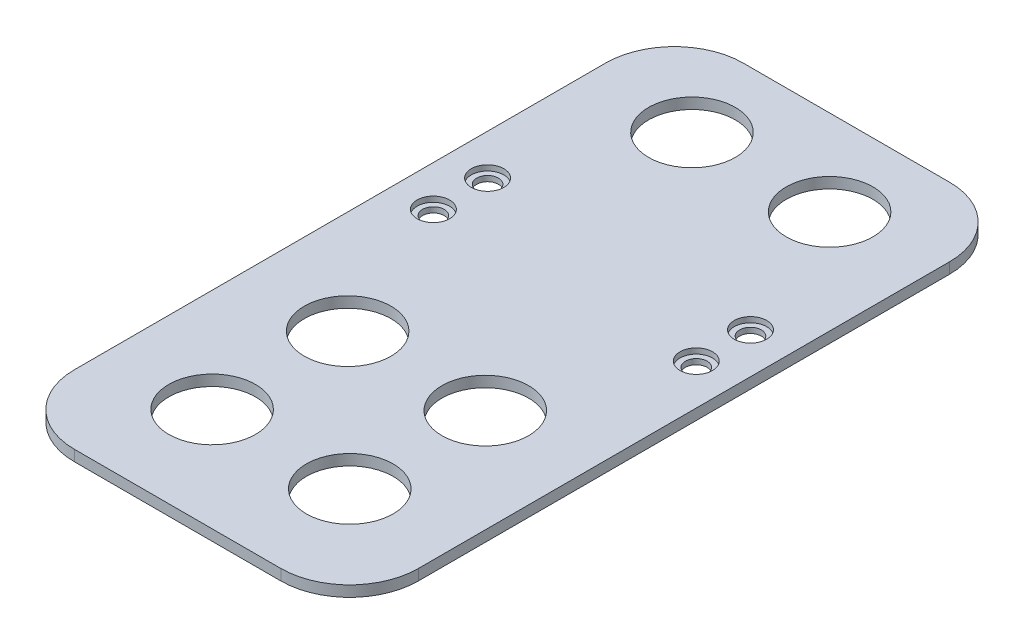
ISO-10303-21;
HEADER;
FILE_DESCRIPTION(('STEP AP214'),'2;1');
FILE_NAME('part.step','',(''),(''),'','','');
FILE_SCHEMA(('AUTOMOTIVE_DESIGN { 1 0 10303 214 1 1 1 1 }'));
ENDSEC;
DATA;
#1=APPLICATION_CONTEXT('core data for automotive mechanical design processes');
#2=APPLICATION_PROTOCOL_DEFINITION('international standard','automotive_design',2000,#1);
#3=PRODUCT_CONTEXT('',#1,'mechanical');
#4=PRODUCT('Part','Part','',(#3));
#5=PRODUCT_RELATED_PRODUCT_CATEGORY('part','',(#4));
#6=PRODUCT_DEFINITION_FORMATION('','',#4);
#7=PRODUCT_DEFINITION_CONTEXT('part definition',#1,'design');
#8=PRODUCT_DEFINITION('design','',#6,#7);
#9=PRODUCT_DEFINITION_SHAPE('','',#8);
#10=(LENGTH_UNIT() NAMED_UNIT(*) SI_UNIT(.MILLI.,.METRE.));
#11=(NAMED_UNIT(*) PLANE_ANGLE_UNIT() SI_UNIT($,.RADIAN.));
#12=(NAMED_UNIT(*) SI_UNIT($,.STERADIAN.) SOLID_ANGLE_UNIT());
#13=UNCERTAINTY_MEASURE_WITH_UNIT(LENGTH_MEASURE(1.E-05),#10,'distance_accuracy_value','');
#14=(GEOMETRIC_REPRESENTATION_CONTEXT(3) GLOBAL_UNCERTAINTY_ASSIGNED_CONTEXT((#13)) GLOBAL_UNIT_ASSIGNED_CONTEXT((#10,
#11,#12)) REPRESENTATION_CONTEXT('',''));
#15=CARTESIAN_POINT('',(0.,0.,0.));
#16=DIRECTION('',(0.,0.,1.));
#17=DIRECTION('',(1.,0.,0.));
#18=AXIS2_PLACEMENT_3D('',#15,#16,#17);
#19=CARTESIAN_POINT('',(24.26,2.,-9.75000000000002));
#20=DIRECTION('',(0.,-1.,0.));
#21=DIRECTION('',(0.,0.,-1.));
#22=AXIS2_PLACEMENT_3D('',#19,#20,#21);
#23=CYLINDRICAL_SURFACE('',#22,2.);
#24=CARTESIAN_POINT('',(24.26,0.,-9.75000000000002));
#25=DIRECTION('',(0.,1.,0.));
#26=DIRECTION('',(0.,0.,1.));
#27=AXIS2_PLACEMENT_3D('',#24,#25,#26);
#28=CIRCLE('',#27,2.);
#29=CARTESIAN_POINT('',(24.26,0.,-7.75000000000002));
#30=VERTEX_POINT('',#29);
#31=EDGE_CURVE('E166',#30,#30,#28,.T.);
#32=ORIENTED_EDGE('',*,*,#31,.F.);
#33=EDGE_LOOP('',(#32));
#34=FACE_BOUND('',#33,.T.);
#35=CARTESIAN_POINT('',(24.26,1.,-9.75000000000002));
#36=DIRECTION('',(0.,1.,0.));
#37=DIRECTION('',(0.,0.,1.));
#38=AXIS2_PLACEMENT_3D('',#35,#36,#37);
#39=CIRCLE('',#38,2.);
#40=CARTESIAN_POINT('',(24.26,1.,-7.75000000000002));
#41=VERTEX_POINT('',#40);
#42=EDGE_CURVE('E40',#41,#41,#39,.T.);
#43=ORIENTED_EDGE('',*,*,#42,.T.);
#44=EDGE_LOOP('',(#43));
#45=FACE_BOUND('',#44,.T.);
#46=ADVANCED_FACE('F36',(#34,#45),#23,.F.);
#47=CARTESIAN_POINT('',(24.26,2.,-19.75));
#48=DIRECTION('',(0.,-1.,0.));
#49=DIRECTION('',(0.,0.,-1.));
#50=AXIS2_PLACEMENT_3D('',#47,#48,#49);
#51=CYLINDRICAL_SURFACE('',#50,2.00000000000001);
#52=CARTESIAN_POINT('',(24.26,0.,-19.75));
#53=DIRECTION('',(0.,1.,0.));
#54=DIRECTION('',(0.,0.,1.));
#55=AXIS2_PLACEMENT_3D('',#52,#53,#54);
#56=CIRCLE('',#55,2.00000000000001);
#57=CARTESIAN_POINT('',(24.26,0.,-17.75));
#58=VERTEX_POINT('',#57);
#59=EDGE_CURVE('E199',#58,#58,#56,.T.);
#60=ORIENTED_EDGE('',*,*,#59,.F.);
#61=EDGE_LOOP('',(#60));
#62=FACE_BOUND('',#61,.T.);
#63=CARTESIAN_POINT('',(24.26,1.,-19.75));
#64=DIRECTION('',(0.,1.,0.));
#65=DIRECTION('',(0.,0.,1.));
#66=AXIS2_PLACEMENT_3D('',#63,#64,#65);
#67=CIRCLE('',#66,2.00000000000001);
#68=CARTESIAN_POINT('',(24.26,1.,-17.75));
#69=VERTEX_POINT('',#68);
#70=EDGE_CURVE('E172',#69,#69,#67,.T.);
#71=ORIENTED_EDGE('',*,*,#70,.T.);
#72=EDGE_LOOP('',(#71));
#73=FACE_BOUND('',#72,.T.);
#74=ADVANCED_FACE('F280',(#62,#73),#51,.F.);
#75=CARTESIAN_POINT('',(-24.26,2.,-9.75000000000001));
#76=DIRECTION('',(0.,-1.,0.));
#77=DIRECTION('',(0.,0.,-1.));
#78=AXIS2_PLACEMENT_3D('',#75,#76,#77);
#79=CYLINDRICAL_SURFACE('',#78,2.);
#80=CARTESIAN_POINT('',(-24.26,0.,-9.75000000000001));
#81=DIRECTION('',(0.,1.,0.));
#82=DIRECTION('',(0.,0.,1.));
#83=AXIS2_PLACEMENT_3D('',#80,#81,#82);
#84=CIRCLE('',#83,2.);
#85=CARTESIAN_POINT('',(-24.26,0.,-7.75));
#86=VERTEX_POINT('',#85);
#87=EDGE_CURVE('E202',#86,#86,#84,.T.);
#88=ORIENTED_EDGE('',*,*,#87,.F.);
#89=EDGE_LOOP('',(#88));
#90=FACE_BOUND('',#89,.T.);
#91=CARTESIAN_POINT('',(-24.26,1.,-9.75000000000001));
#92=DIRECTION('',(0.,1.,0.));
#93=DIRECTION('',(0.,0.,1.));
#94=AXIS2_PLACEMENT_3D('',#91,#92,#93);
#95=CIRCLE('',#94,2.);
#96=CARTESIAN_POINT('',(-24.26,1.,-7.75));
#97=VERTEX_POINT('',#96);
#98=EDGE_CURVE('E168',#97,#97,#95,.T.);
#99=ORIENTED_EDGE('',*,*,#98,.T.);
#100=EDGE_LOOP('',(#99));
#101=FACE_BOUND('',#100,.T.);
#102=ADVANCED_FACE('F286',(#90,#101),#79,.F.);
#103=CARTESIAN_POINT('',(-24.26,2.,-19.75));
#104=DIRECTION('',(0.,-1.,0.));
#105=DIRECTION('',(0.,0.,-1.));
#106=AXIS2_PLACEMENT_3D('',#103,#104,#105);
#107=CYLINDRICAL_SURFACE('',#106,2.);
#108=CARTESIAN_POINT('',(-24.26,0.,-19.75));
#109=DIRECTION('',(0.,1.,0.));
#110=DIRECTION('',(0.,0.,1.));
#111=AXIS2_PLACEMENT_3D('',#108,#109,#110);
#112=CIRCLE('',#111,2.);
#113=CARTESIAN_POINT('',(-24.26,0.,-17.75));
#114=VERTEX_POINT('',#113);
#115=EDGE_CURVE('E205',#114,#114,#112,.T.);
#116=ORIENTED_EDGE('',*,*,#115,.F.);
#117=EDGE_LOOP('',(#116));
#118=FACE_BOUND('',#117,.T.);
#119=CARTESIAN_POINT('',(-24.26,1.,-19.75));
#120=DIRECTION('',(0.,1.,0.));
#121=DIRECTION('',(0.,0.,1.));
#122=AXIS2_PLACEMENT_3D('',#119,#120,#121);
#123=CIRCLE('',#122,2.);
#124=CARTESIAN_POINT('',(-24.26,1.,-17.75));
#125=VERTEX_POINT('',#124);
#126=EDGE_CURVE('E163',#125,#125,#123,.T.);
#127=ORIENTED_EDGE('',*,*,#126,.T.);
#128=EDGE_LOOP('',(#127));
#129=FACE_BOUND('',#128,.T.);
#130=ADVANCED_FACE('F297',(#118,#129),#107,.F.);
#131=CARTESIAN_POINT('',(-19.05,2.,-49.02));
#132=DIRECTION('',(0.,1.,0.));
#133=DIRECTION('',(0.,0.,1.));
#134=AXIS2_PLACEMENT_3D('',#131,#132,#133);
#135=PLANE('',#134);
#136=CARTESIAN_POINT('',(24.26,2.,-9.75000000000002));
#137=DIRECTION('',(0.,1.,0.));
#138=DIRECTION('',(0.,0.,1.));
#139=AXIS2_PLACEMENT_3D('',#136,#137,#138);
#140=CIRCLE('',#139,3.);
#141=CARTESIAN_POINT('',(24.26,2.,-6.75000000000002));
#142=VERTEX_POINT('',#141);
#143=EDGE_CURVE('E188',#142,#142,#140,.T.);
#144=ORIENTED_EDGE('',*,*,#143,.F.);
#145=EDGE_LOOP('',(#144));
#146=FACE_BOUND('',#145,.T.);
#147=CARTESIAN_POINT('',(24.26,2.,-19.75));
#148=DIRECTION('',(0.,1.,0.));
#149=DIRECTION('',(0.,0.,1.));
#150=AXIS2_PLACEMENT_3D('',#147,#148,#149);
#151=CIRCLE('',#150,3.);
#152=CARTESIAN_POINT('',(24.26,2.,-16.75));
#153=VERTEX_POINT('',#152);
#154=EDGE_CURVE('E181',#153,#153,#151,.T.);
#155=ORIENTED_EDGE('',*,*,#154,.F.);
#156=EDGE_LOOP('',(#155));
#157=FACE_BOUND('',#156,.T.);
#158=CARTESIAN_POINT('',(-24.26,2.,-9.75000000000001));
#159=DIRECTION('',(0.,1.,0.));
#160=DIRECTION('',(0.,0.,1.));
#161=AXIS2_PLACEMENT_3D('',#158,#159,#160);
#162=CIRCLE('',#161,3.);
#163=CARTESIAN_POINT('',(-24.26,2.,-6.75));
#164=VERTEX_POINT('',#163);
#165=EDGE_CURVE('E174',#164,#164,#162,.T.);
#166=ORIENTED_EDGE('',*,*,#165,.F.);
#167=EDGE_LOOP('',(#166));
#168=FACE_BOUND('',#167,.T.);
#169=CARTESIAN_POINT('',(-24.26,2.,-19.75));
#170=DIRECTION('',(0.,1.,0.));
#171=DIRECTION('',(0.,0.,1.));
#172=AXIS2_PLACEMENT_3D('',#169,#170,#171);
#173=CIRCLE('',#172,3.);
#174=CARTESIAN_POINT('',(-24.26,2.,-16.75));
#175=VERTEX_POINT('',#174);
#176=EDGE_CURVE('E170',#175,#175,#173,.T.);
#177=ORIENTED_EDGE('',*,*,#176,.F.);
#178=EDGE_LOOP('',(#177));
#179=FACE_BOUND('',#178,.T.);
#180=CARTESIAN_POINT('',(12.7,2.,17.63));
#181=DIRECTION('',(0.,1.,0.));
#182=DIRECTION('',(0.,0.,1.));
#183=AXIS2_PLACEMENT_3D('',#180,#181,#182);
#184=CIRCLE('',#183,8.);
#185=CARTESIAN_POINT('',(12.7,2.,25.63));
#186=VERTEX_POINT('',#185);
#187=EDGE_CURVE('E215',#186,#186,#184,.T.);
#188=ORIENTED_EDGE('',*,*,#187,.F.);
#189=EDGE_LOOP('',(#188));
#190=FACE_BOUND('',#189,.T.);
#191=CARTESIAN_POINT('',(-12.7,2.,42.64));
#192=DIRECTION('',(0.,1.,0.));
#193=DIRECTION('',(0.,0.,1.));
#194=AXIS2_PLACEMENT_3D('',#191,#192,#193);
#195=CIRCLE('',#194,8.);
#196=CARTESIAN_POINT('',(-12.7,2.,50.64));
#197=VERTEX_POINT('',#196);
#198=EDGE_CURVE('E227',#197,#197,#195,.T.);
#199=ORIENTED_EDGE('',*,*,#198,.F.);
#200=EDGE_LOOP('',(#199));
#201=FACE_BOUND('',#200,.T.);
#202=CARTESIAN_POINT('',(-12.7,2.,-45.91));
#203=DIRECTION('',(0.,1.,0.));
#204=DIRECTION('',(0.,0.,1.));
#205=AXIS2_PLACEMENT_3D('',#202,#203,#204);
#206=CIRCLE('',#205,8.);
#207=CARTESIAN_POINT('',(-12.7,2.,-37.91));
#208=VERTEX_POINT('',#207);
#209=EDGE_CURVE('E140',#208,#208,#206,.T.);
#210=ORIENTED_EDGE('',*,*,#209,.F.);
#211=EDGE_LOOP('',(#210));
#212=FACE_BOUND('',#211,.T.);
#213=CARTESIAN_POINT('',(-19.05,2.,-49.02));
#214=DIRECTION('',(0.,1.,0.));
#215=DIRECTION('',(0.,0.,1.));
#216=AXIS2_PLACEMENT_3D('',#213,#214,#215);
#217=CIRCLE('',#216,12.7);
#218=CARTESIAN_POINT('',(-19.0499999999999,2.,-61.72));
#219=VERTEX_POINT('',#218);
#220=CARTESIAN_POINT('',(-31.75,2.,-49.0199999999999));
#221=VERTEX_POINT('',#220);
#222=EDGE_CURVE('E151',#219,#221,#217,.T.);
#223=ORIENTED_EDGE('',*,*,#222,.T.);
#224=DIRECTION('',(0.,0.,1.));
#225=VECTOR('',#224,1.);
#226=CARTESIAN_POINT('',(-31.75,2.,49.0199999999999));
#227=LINE('',#226,#225);
#228=CARTESIAN_POINT('',(-31.75,2.,49.0199999999999));
#229=VERTEX_POINT('',#228);
#230=EDGE_CURVE('E98',#221,#229,#227,.T.);
#231=ORIENTED_EDGE('',*,*,#230,.T.);
#232=CARTESIAN_POINT('',(-19.05,2.,49.02));
#233=DIRECTION('',(0.,1.,0.));
#234=DIRECTION('',(0.,0.,-1.));
#235=AXIS2_PLACEMENT_3D('',#232,#233,#234);
#236=CIRCLE('',#235,12.7);
#237=CARTESIAN_POINT('',(-19.0499999999999,2.,61.72));
#238=VERTEX_POINT('',#237);
#239=EDGE_CURVE('E245',#229,#238,#236,.T.);
#240=ORIENTED_EDGE('',*,*,#239,.T.);
#241=DIRECTION('',(1.,0.,0.));
#242=VECTOR('',#241,1.);
#243=CARTESIAN_POINT('',(19.0499999999999,2.,61.72));
#244=LINE('',#243,#242);
#245=CARTESIAN_POINT('',(19.0499999999999,2.,61.72));
#246=VERTEX_POINT('',#245);
#247=EDGE_CURVE('E247',#238,#246,#244,.T.);
#248=ORIENTED_EDGE('',*,*,#247,.T.);
#249=CARTESIAN_POINT('',(19.05,2.,49.02));
#250=DIRECTION('',(0.,1.,0.));
#251=DIRECTION('',(0.,0.,-1.));
#252=AXIS2_PLACEMENT_3D('',#249,#250,#251);
#253=CIRCLE('',#252,12.7);
#254=CARTESIAN_POINT('',(31.75,2.,49.0199999999999));
#255=VERTEX_POINT('',#254);
#256=EDGE_CURVE('E118',#246,#255,#253,.T.);
#257=ORIENTED_EDGE('',*,*,#256,.T.);
#258=DIRECTION('',(0.,0.,-1.));
#259=VECTOR('',#258,1.);
#260=CARTESIAN_POINT('',(31.75,2.,49.0199999999999));
#261=LINE('',#260,#259);
#262=CARTESIAN_POINT('',(31.75,2.,-49.0199999999999));
#263=VERTEX_POINT('',#262);
#264=EDGE_CURVE('E111',#255,#263,#261,.T.);
#265=ORIENTED_EDGE('',*,*,#264,.T.);
#266=CARTESIAN_POINT('',(19.05,2.,-49.02));
#267=DIRECTION('',(0.,1.,0.));
#268=DIRECTION('',(0.,0.,1.));
#269=AXIS2_PLACEMENT_3D('',#266,#267,#268);
#270=CIRCLE('',#269,12.7);
#271=CARTESIAN_POINT('',(19.0499999999999,2.,-61.72));
#272=VERTEX_POINT('',#271);
#273=EDGE_CURVE('E116',#263,#272,#270,.T.);
#274=ORIENTED_EDGE('',*,*,#273,.T.);
#275=DIRECTION('',(-1.,0.,0.));
#276=VECTOR('',#275,1.);
#277=CARTESIAN_POINT('',(19.0499999999999,2.,-61.72));
#278=LINE('',#277,#276);
#279=EDGE_CURVE('E55',#272,#219,#278,.T.);
#280=ORIENTED_EDGE('',*,*,#279,.T.);
#281=EDGE_LOOP('',(#223,#231,#240,#248,#257,#265,#274,#280));
#282=FACE_BOUND('',#281,.T.);
#283=CARTESIAN_POINT('',(12.7,2.,-45.91));
#284=DIRECTION('',(0.,1.,0.));
#285=DIRECTION('',(0.,0.,1.));
#286=AXIS2_PLACEMENT_3D('',#283,#284,#285);
#287=CIRCLE('',#286,8.);
#288=CARTESIAN_POINT('',(12.7,2.,-37.91));
#289=VERTEX_POINT('',#288);
#290=EDGE_CURVE('E233',#289,#289,#287,.T.);
#291=ORIENTED_EDGE('',*,*,#290,.F.);
#292=EDGE_LOOP('',(#291));
#293=FACE_BOUND('',#292,.T.);
#294=CARTESIAN_POINT('',(12.7,2.,42.64));
#295=DIRECTION('',(0.,1.,0.));
#296=DIRECTION('',(0.,0.,1.));
#297=AXIS2_PLACEMENT_3D('',#294,#295,#296);
#298=CIRCLE('',#297,8.);
#299=CARTESIAN_POINT('',(12.7,2.,50.64));
#300=VERTEX_POINT('',#299);
#301=EDGE_CURVE('E221',#300,#300,#298,.T.);
#302=ORIENTED_EDGE('',*,*,#301,.F.);
#303=EDGE_LOOP('',(#302));
#304=FACE_BOUND('',#303,.T.);
#305=CARTESIAN_POINT('',(-12.7,2.,17.63));
#306=DIRECTION('',(0.,1.,0.));
#307=DIRECTION('',(0.,0.,1.));
#308=AXIS2_PLACEMENT_3D('',#305,#306,#307);
#309=CIRCLE('',#308,8.);
#310=CARTESIAN_POINT('',(-12.7,2.,25.63));
#311=VERTEX_POINT('',#310);
#312=EDGE_CURVE('E209',#311,#311,#309,.T.);
#313=ORIENTED_EDGE('',*,*,#312,.F.);
#314=EDGE_LOOP('',(#313));
#315=FACE_BOUND('',#314,.T.);
#316=ADVANCED_FACE('F113',(#146,#157,#168,#179,#190,#201,#212,#282,#293,#304,#315),#135,.T.);
#317=CARTESIAN_POINT('',(-19.05,0.,-49.02));
#318=DIRECTION('',(0.,1.,0.));
#319=DIRECTION('',(0.,0.,1.));
#320=AXIS2_PLACEMENT_3D('',#317,#318,#319);
#321=PLANE('',#320);
#322=ORIENTED_EDGE('',*,*,#59,.T.);
#323=EDGE_LOOP('',(#322));
#324=FACE_BOUND('',#323,.T.);
#325=ORIENTED_EDGE('',*,*,#115,.T.);
#326=EDGE_LOOP('',(#325));
#327=FACE_BOUND('',#326,.T.);
#328=CARTESIAN_POINT('',(12.7,0.,17.63));
#329=DIRECTION('',(0.,1.,0.));
#330=DIRECTION('',(0.,0.,1.));
#331=AXIS2_PLACEMENT_3D('',#328,#329,#330);
#332=CIRCLE('',#331,8.);
#333=CARTESIAN_POINT('',(12.7,0.,25.63));
#334=VERTEX_POINT('',#333);
#335=EDGE_CURVE('E212',#334,#334,#332,.T.);
#336=ORIENTED_EDGE('',*,*,#335,.T.);
#337=EDGE_LOOP('',(#336));
#338=FACE_BOUND('',#337,.T.);
#339=CARTESIAN_POINT('',(-12.7,0.,42.64));
#340=DIRECTION('',(0.,1.,0.));
#341=DIRECTION('',(0.,0.,1.));
#342=AXIS2_PLACEMENT_3D('',#339,#340,#341);
#343=CIRCLE('',#342,8.);
#344=CARTESIAN_POINT('',(-12.7,0.,50.64));
#345=VERTEX_POINT('',#344);
#346=EDGE_CURVE('E224',#345,#345,#343,.T.);
#347=ORIENTED_EDGE('',*,*,#346,.T.);
#348=EDGE_LOOP('',(#347));
#349=FACE_BOUND('',#348,.T.);
#350=CARTESIAN_POINT('',(-12.7,0.,-45.91));
#351=DIRECTION('',(0.,1.,0.));
#352=DIRECTION('',(0.,0.,1.));
#353=AXIS2_PLACEMENT_3D('',#350,#351,#352);
#354=CIRCLE('',#353,8.);
#355=CARTESIAN_POINT('',(-12.7,0.,-37.91));
#356=VERTEX_POINT('',#355);
#357=EDGE_CURVE('E236',#356,#356,#354,.T.);
#358=ORIENTED_EDGE('',*,*,#357,.T.);
#359=EDGE_LOOP('',(#358));
#360=FACE_BOUND('',#359,.T.);
#361=CARTESIAN_POINT('',(-19.05,0.,-49.02));
#362=DIRECTION('',(0.,1.,0.));
#363=DIRECTION('',(0.,0.,1.));
#364=AXIS2_PLACEMENT_3D('',#361,#362,#363);
#365=CIRCLE('',#364,12.7);
#366=CARTESIAN_POINT('',(-19.0499999999999,0.,-61.72));
#367=VERTEX_POINT('',#366);
#368=CARTESIAN_POINT('',(-31.75,0.,-49.0199999999999));
#369=VERTEX_POINT('',#368);
#370=EDGE_CURVE('E136',#367,#369,#365,.T.);
#371=ORIENTED_EDGE('',*,*,#370,.F.);
#372=DIRECTION('',(-1.,0.,0.));
#373=VECTOR('',#372,1.);
#374=CARTESIAN_POINT('',(19.0499999999999,0.,-61.72));
#375=LINE('',#374,#373);
#376=CARTESIAN_POINT('',(19.0499999999999,0.,-61.72));
#377=VERTEX_POINT('',#376);
#378=EDGE_CURVE('E90',#377,#367,#375,.T.);
#379=ORIENTED_EDGE('',*,*,#378,.F.);
#380=CARTESIAN_POINT('',(19.05,0.,-49.02));
#381=DIRECTION('',(0.,1.,0.));
#382=DIRECTION('',(0.,0.,1.));
#383=AXIS2_PLACEMENT_3D('',#380,#381,#382);
#384=CIRCLE('',#383,12.7);
#385=CARTESIAN_POINT('',(31.75,0.,-49.0199999999999));
#386=VERTEX_POINT('',#385);
#387=EDGE_CURVE('E84',#386,#377,#384,.T.);
#388=ORIENTED_EDGE('',*,*,#387,.F.);
#389=DIRECTION('',(0.,0.,-1.));
#390=VECTOR('',#389,1.);
#391=CARTESIAN_POINT('',(31.75,0.,49.0199999999999));
#392=LINE('',#391,#390);
#393=CARTESIAN_POINT('',(31.75,0.,49.0199999999999));
#394=VERTEX_POINT('',#393);
#395=EDGE_CURVE('E126',#394,#386,#392,.T.);
#396=ORIENTED_EDGE('',*,*,#395,.F.);
#397=CARTESIAN_POINT('',(19.05,0.,49.02));
#398=DIRECTION('',(0.,1.,0.));
#399=DIRECTION('',(0.,0.,-1.));
#400=AXIS2_PLACEMENT_3D('',#397,#398,#399);
#401=CIRCLE('',#400,12.7);
#402=CARTESIAN_POINT('',(19.0499999999999,0.,61.72));
#403=VERTEX_POINT('',#402);
#404=EDGE_CURVE('E146',#403,#394,#401,.T.);
#405=ORIENTED_EDGE('',*,*,#404,.F.);
#406=DIRECTION('',(1.,0.,0.));
#407=VECTOR('',#406,1.);
#408=CARTESIAN_POINT('',(19.0499999999999,0.,61.72));
#409=LINE('',#408,#407);
#410=CARTESIAN_POINT('',(-19.0499999999999,0.,61.72));
#411=VERTEX_POINT('',#410);
#412=EDGE_CURVE('E144',#411,#403,#409,.T.);
#413=ORIENTED_EDGE('',*,*,#412,.F.);
#414=CARTESIAN_POINT('',(-19.05,0.,49.02));
#415=DIRECTION('',(0.,1.,0.));
#416=DIRECTION('',(0.,0.,-1.));
#417=AXIS2_PLACEMENT_3D('',#414,#415,#416);
#418=CIRCLE('',#417,12.7);
#419=CARTESIAN_POINT('',(-31.75,0.,49.0199999999999));
#420=VERTEX_POINT('',#419);
#421=EDGE_CURVE('E142',#420,#411,#418,.T.);
#422=ORIENTED_EDGE('',*,*,#421,.F.);
#423=DIRECTION('',(0.,0.,1.));
#424=VECTOR('',#423,1.);
#425=CARTESIAN_POINT('',(-31.75,0.,49.0199999999999));
#426=LINE('',#425,#424);
#427=EDGE_CURVE('E139',#369,#420,#426,.T.);
#428=ORIENTED_EDGE('',*,*,#427,.F.);
#429=EDGE_LOOP('',(#371,#379,#388,#396,#405,#413,#422,#428));
#430=FACE_BOUND('',#429,.T.);
#431=CARTESIAN_POINT('',(12.7,0.,-45.91));
#432=DIRECTION('',(0.,1.,0.));
#433=DIRECTION('',(0.,0.,1.));
#434=AXIS2_PLACEMENT_3D('',#431,#432,#433);
#435=CIRCLE('',#434,8.);
#436=CARTESIAN_POINT('',(12.7,0.,-37.91));
#437=VERTEX_POINT('',#436);
#438=EDGE_CURVE('E230',#437,#437,#435,.T.);
#439=ORIENTED_EDGE('',*,*,#438,.T.);
#440=EDGE_LOOP('',(#439));
#441=FACE_BOUND('',#440,.T.);
#442=CARTESIAN_POINT('',(12.7,0.,42.64));
#443=DIRECTION('',(0.,1.,0.));
#444=DIRECTION('',(0.,0.,1.));
#445=AXIS2_PLACEMENT_3D('',#442,#443,#444);
#446=CIRCLE('',#445,8.);
#447=CARTESIAN_POINT('',(12.7,0.,50.64));
#448=VERTEX_POINT('',#447);
#449=EDGE_CURVE('E218',#448,#448,#446,.T.);
#450=ORIENTED_EDGE('',*,*,#449,.T.);
#451=EDGE_LOOP('',(#450));
#452=FACE_BOUND('',#451,.T.);
#453=CARTESIAN_POINT('',(-12.7,0.,17.63));
#454=DIRECTION('',(0.,1.,0.));
#455=DIRECTION('',(0.,0.,1.));
#456=AXIS2_PLACEMENT_3D('',#453,#454,#455);
#457=CIRCLE('',#456,8.);
#458=CARTESIAN_POINT('',(-12.7,0.,25.63));
#459=VERTEX_POINT('',#458);
#460=EDGE_CURVE('E208',#459,#459,#457,.T.);
#461=ORIENTED_EDGE('',*,*,#460,.T.);
#462=EDGE_LOOP('',(#461));
#463=FACE_BOUND('',#462,.T.);
#464=ORIENTED_EDGE('',*,*,#87,.T.);
#465=EDGE_LOOP('',(#464));
#466=FACE_BOUND('',#465,.T.);
#467=ORIENTED_EDGE('',*,*,#31,.T.);
#468=EDGE_LOOP('',(#467));
#469=FACE_BOUND('',#468,.T.);
#470=ADVANCED_FACE('F260',(#324,#327,#338,#349,#360,#430,#441,#452,#463,#466,#469),#321,.F.);
#471=CARTESIAN_POINT('',(-19.05,2.,-49.02));
#472=DIRECTION('',(0.,-1.,0.));
#473=DIRECTION('',(0.,0.,-1.));
#474=AXIS2_PLACEMENT_3D('',#471,#472,#473);
#475=CYLINDRICAL_SURFACE('',#474,12.7);
#476=ORIENTED_EDGE('',*,*,#370,.T.);
#477=DIRECTION('',(0.,-1.,0.));
#478=VECTOR('',#477,1.);
#479=CARTESIAN_POINT('',(-31.75,2.,-49.0199999999999));
#480=LINE('',#479,#478);
#481=EDGE_CURVE('E11',#221,#369,#480,.T.);
#482=ORIENTED_EDGE('',*,*,#481,.F.);
#483=ORIENTED_EDGE('',*,*,#222,.F.);
#484=DIRECTION('',(0.,-1.,0.));
#485=VECTOR('',#484,1.);
#486=CARTESIAN_POINT('',(-19.0499999999999,2.,-61.72));
#487=LINE('',#486,#485);
#488=EDGE_CURVE('E132',#219,#367,#487,.T.);
#489=ORIENTED_EDGE('',*,*,#488,.T.);
#490=EDGE_LOOP('',(#476,#482,#483,#489));
#491=FACE_BOUND('',#490,.T.);
#492=ADVANCED_FACE('F38',(#491),#475,.T.);
#493=CARTESIAN_POINT('',(-31.75,2.,49.0199999999999));
#494=DIRECTION('',(1.,0.,0.));
#495=DIRECTION('',(0.,0.,-1.));
#496=AXIS2_PLACEMENT_3D('',#493,#494,#495);
#497=PLANE('',#496);
#498=ORIENTED_EDGE('',*,*,#427,.T.);
#499=DIRECTION('',(0.,-1.,0.));
#500=VECTOR('',#499,1.);
#501=CARTESIAN_POINT('',(-31.75,2.,49.0199999999999));
#502=LINE('',#501,#500);
#503=EDGE_CURVE('E46',#229,#420,#502,.T.);
#504=ORIENTED_EDGE('',*,*,#503,.F.);
#505=ORIENTED_EDGE('',*,*,#230,.F.);
#506=ORIENTED_EDGE('',*,*,#481,.T.);
#507=EDGE_LOOP('',(#498,#504,#505,#506));
#508=FACE_BOUND('',#507,.T.);
#509=ADVANCED_FACE('F328',(#508),#497,.F.);
#510=CARTESIAN_POINT('',(-19.05,2.,49.02));
#511=DIRECTION('',(0.,-1.,0.));
#512=DIRECTION('',(0.,0.,-1.));
#513=AXIS2_PLACEMENT_3D('',#510,#511,#512);
#514=CYLINDRICAL_SURFACE('',#513,12.7);
#515=ORIENTED_EDGE('',*,*,#421,.T.);
#516=DIRECTION('',(0.,-1.,0.));
#517=VECTOR('',#516,1.);
#518=CARTESIAN_POINT('',(-19.0499999999999,2.,61.72));
#519=LINE('',#518,#517);
#520=EDGE_CURVE('E158',#238,#411,#519,.T.);
#521=ORIENTED_EDGE('',*,*,#520,.F.);
#522=ORIENTED_EDGE('',*,*,#239,.F.);
#523=ORIENTED_EDGE('',*,*,#503,.T.);
#524=EDGE_LOOP('',(#515,#521,#522,#523));
#525=FACE_BOUND('',#524,.T.);
#526=ADVANCED_FACE('F511',(#525),#514,.T.);
#527=CARTESIAN_POINT('',(19.0499999999999,2.,61.72));
#528=DIRECTION('',(0.,0.,-1.));
#529=DIRECTION('',(-1.,0.,0.));
#530=AXIS2_PLACEMENT_3D('',#527,#528,#529);
#531=PLANE('',#530);
#532=ORIENTED_EDGE('',*,*,#412,.T.);
#533=DIRECTION('',(0.,-1.,0.));
#534=VECTOR('',#533,1.);
#535=CARTESIAN_POINT('',(19.0499999999999,2.,61.72));
#536=LINE('',#535,#534);
#537=EDGE_CURVE('E155',#246,#403,#536,.T.);
#538=ORIENTED_EDGE('',*,*,#537,.F.);
#539=ORIENTED_EDGE('',*,*,#247,.F.);
#540=ORIENTED_EDGE('',*,*,#520,.T.);
#541=EDGE_LOOP('',(#532,#538,#539,#540));
#542=FACE_BOUND('',#541,.T.);
#543=ADVANCED_FACE('F253',(#542),#531,.F.);
#544=CARTESIAN_POINT('',(19.05,2.,49.02));
#545=DIRECTION('',(0.,-1.,0.));
#546=DIRECTION('',(0.,0.,-1.));
#547=AXIS2_PLACEMENT_3D('',#544,#545,#546);
#548=CYLINDRICAL_SURFACE('',#547,12.7);
#549=ORIENTED_EDGE('',*,*,#404,.T.);
#550=DIRECTION('',(0.,-1.,0.));
#551=VECTOR('',#550,1.);
#552=CARTESIAN_POINT('',(31.75,2.,49.0199999999999));
#553=LINE('',#552,#551);
#554=EDGE_CURVE('E127',#255,#394,#553,.T.);
#555=ORIENTED_EDGE('',*,*,#554,.F.);
#556=ORIENTED_EDGE('',*,*,#256,.F.);
#557=ORIENTED_EDGE('',*,*,#537,.T.);
#558=EDGE_LOOP('',(#549,#555,#556,#557));
#559=FACE_BOUND('',#558,.T.);
#560=ADVANCED_FACE('F257',(#559),#548,.T.);
#561=CARTESIAN_POINT('',(31.75,2.,49.0199999999999));
#562=DIRECTION('',(-1.,0.,0.));
#563=DIRECTION('',(0.,0.,1.));
#564=AXIS2_PLACEMENT_3D('',#561,#562,#563);
#565=PLANE('',#564);
#566=ORIENTED_EDGE('',*,*,#395,.T.);
#567=DIRECTION('',(0.,-1.,0.));
#568=VECTOR('',#567,1.);
#569=CARTESIAN_POINT('',(31.75,2.,-49.0199999999999));
#570=LINE('',#569,#568);
#571=EDGE_CURVE('E123',#263,#386,#570,.T.);
#572=ORIENTED_EDGE('',*,*,#571,.F.);
#573=ORIENTED_EDGE('',*,*,#264,.F.);
#574=ORIENTED_EDGE('',*,*,#554,.T.);
#575=EDGE_LOOP('',(#566,#572,#573,#574));
#576=FACE_BOUND('',#575,.T.);
#577=ADVANCED_FACE('F124',(#576),#565,.F.);
#578=CARTESIAN_POINT('',(19.05,2.,-49.02));
#579=DIRECTION('',(0.,-1.,0.));
#580=DIRECTION('',(0.,0.,-1.));
#581=AXIS2_PLACEMENT_3D('',#578,#579,#580);
#582=CYLINDRICAL_SURFACE('',#581,12.7);
#583=ORIENTED_EDGE('',*,*,#387,.T.);
#584=DIRECTION('',(0.,-1.,0.));
#585=VECTOR('',#584,1.);
#586=CARTESIAN_POINT('',(19.0499999999999,2.,-61.72));
#587=LINE('',#586,#585);
#588=EDGE_CURVE('E128',#272,#377,#587,.T.);
#589=ORIENTED_EDGE('',*,*,#588,.F.);
#590=ORIENTED_EDGE('',*,*,#273,.F.);
#591=ORIENTED_EDGE('',*,*,#571,.T.);
#592=EDGE_LOOP('',(#583,#589,#590,#591));
#593=FACE_BOUND('',#592,.T.);
#594=ADVANCED_FACE('F130',(#593),#582,.T.);
#595=CARTESIAN_POINT('',(19.0499999999999,2.,-61.72));
#596=DIRECTION('',(0.,0.,1.));
#597=DIRECTION('',(1.,0.,0.));
#598=AXIS2_PLACEMENT_3D('',#595,#596,#597);
#599=PLANE('',#598);
#600=ORIENTED_EDGE('',*,*,#378,.T.);
#601=ORIENTED_EDGE('',*,*,#488,.F.);
#602=ORIENTED_EDGE('',*,*,#279,.F.);
#603=ORIENTED_EDGE('',*,*,#588,.T.);
#604=EDGE_LOOP('',(#600,#601,#602,#603));
#605=FACE_BOUND('',#604,.T.);
#606=ADVANCED_FACE('F266',(#605),#599,.F.);
#607=CARTESIAN_POINT('',(-12.7,2.,-45.91));
#608=DIRECTION('',(0.,-1.,0.));
#609=DIRECTION('',(0.,0.,-1.));
#610=AXIS2_PLACEMENT_3D('',#607,#608,#609);
#611=CYLINDRICAL_SURFACE('',#610,8.);
#612=ORIENTED_EDGE('',*,*,#209,.T.);
#613=EDGE_LOOP('',(#612));
#614=FACE_BOUND('',#613,.T.);
#615=ORIENTED_EDGE('',*,*,#357,.F.);
#616=EDGE_LOOP('',(#615));
#617=FACE_BOUND('',#616,.T.);
#618=ADVANCED_FACE('F268',(#614,#617),#611,.F.);
#619=CARTESIAN_POINT('',(12.7,2.,-45.91));
#620=DIRECTION('',(0.,-1.,0.));
#621=DIRECTION('',(0.,0.,-1.));
#622=AXIS2_PLACEMENT_3D('',#619,#620,#621);
#623=CYLINDRICAL_SURFACE('',#622,8.);
#624=ORIENTED_EDGE('',*,*,#290,.T.);
#625=EDGE_LOOP('',(#624));
#626=FACE_BOUND('',#625,.T.);
#627=ORIENTED_EDGE('',*,*,#438,.F.);
#628=EDGE_LOOP('',(#627));
#629=FACE_BOUND('',#628,.T.);
#630=ADVANCED_FACE('F274',(#626,#629),#623,.F.);
#631=CARTESIAN_POINT('',(-12.7,2.,42.64));
#632=DIRECTION('',(0.,-1.,0.));
#633=DIRECTION('',(0.,0.,-1.));
#634=AXIS2_PLACEMENT_3D('',#631,#632,#633);
#635=CYLINDRICAL_SURFACE('',#634,8.);
#636=ORIENTED_EDGE('',*,*,#198,.T.);
#637=EDGE_LOOP('',(#636));
#638=FACE_BOUND('',#637,.T.);
#639=ORIENTED_EDGE('',*,*,#346,.F.);
#640=EDGE_LOOP('',(#639));
#641=FACE_BOUND('',#640,.T.);
#642=ADVANCED_FACE('F313',(#638,#641),#635,.F.);
#643=CARTESIAN_POINT('',(12.7,2.,42.64));
#644=DIRECTION('',(0.,-1.,0.));
#645=DIRECTION('',(0.,0.,-1.));
#646=AXIS2_PLACEMENT_3D('',#643,#644,#645);
#647=CYLINDRICAL_SURFACE('',#646,8.);
#648=ORIENTED_EDGE('',*,*,#301,.T.);
#649=EDGE_LOOP('',(#648));
#650=FACE_BOUND('',#649,.T.);
#651=ORIENTED_EDGE('',*,*,#449,.F.);
#652=EDGE_LOOP('',(#651));
#653=FACE_BOUND('',#652,.T.);
#654=ADVANCED_FACE('F309',(#650,#653),#647,.F.);
#655=CARTESIAN_POINT('',(12.7,2.,17.63));
#656=DIRECTION('',(0.,-1.,0.));
#657=DIRECTION('',(0.,0.,-1.));
#658=AXIS2_PLACEMENT_3D('',#655,#656,#657);
#659=CYLINDRICAL_SURFACE('',#658,8.);
#660=ORIENTED_EDGE('',*,*,#187,.T.);
#661=EDGE_LOOP('',(#660));
#662=FACE_BOUND('',#661,.T.);
#663=ORIENTED_EDGE('',*,*,#335,.F.);
#664=EDGE_LOOP('',(#663));
#665=FACE_BOUND('',#664,.T.);
#666=ADVANCED_FACE('F305',(#662,#665),#659,.F.);
#667=CARTESIAN_POINT('',(-12.7,2.,17.63));
#668=DIRECTION('',(0.,-1.,0.));
#669=DIRECTION('',(0.,0.,-1.));
#670=AXIS2_PLACEMENT_3D('',#667,#668,#669);
#671=CYLINDRICAL_SURFACE('',#670,8.);
#672=ORIENTED_EDGE('',*,*,#312,.T.);
#673=EDGE_LOOP('',(#672));
#674=FACE_BOUND('',#673,.T.);
#675=ORIENTED_EDGE('',*,*,#460,.F.);
#676=EDGE_LOOP('',(#675));
#677=FACE_BOUND('',#676,.T.);
#678=ADVANCED_FACE('F302',(#674,#677),#671,.F.);
#679=CARTESIAN_POINT('',(-24.26,1.,-19.75));
#680=DIRECTION('',(0.,1.,0.));
#681=DIRECTION('',(0.,0.,1.));
#682=AXIS2_PLACEMENT_3D('',#679,#680,#681);
#683=CYLINDRICAL_SURFACE('',#682,3.);
#684=CARTESIAN_POINT('',(-24.26,1.,-19.75));
#685=DIRECTION('',(0.,1.,0.));
#686=DIRECTION('',(0.,0.,1.));
#687=AXIS2_PLACEMENT_3D('',#684,#685,#686);
#688=CIRCLE('',#687,3.);
#689=CARTESIAN_POINT('',(-24.26,1.,-16.75));
#690=VERTEX_POINT('',#689);
#691=EDGE_CURVE('E167',#690,#690,#688,.T.);
#692=ORIENTED_EDGE('',*,*,#691,.F.);
#693=EDGE_LOOP('',(#692));
#694=FACE_BOUND('',#693,.T.);
#695=ORIENTED_EDGE('',*,*,#176,.T.);
#696=EDGE_LOOP('',(#695));
#697=FACE_BOUND('',#696,.T.);
#698=ADVANCED_FACE('F292',(#694,#697),#683,.F.);
#699=CARTESIAN_POINT('',(-24.26,1.,-19.75));
#700=DIRECTION('',(0.,1.,0.));
#701=DIRECTION('',(0.,0.,1.));
#702=AXIS2_PLACEMENT_3D('',#699,#700,#701);
#703=PLANE('',#702);
#704=ORIENTED_EDGE('',*,*,#126,.F.);
#705=EDGE_LOOP('',(#704));
#706=FACE_BOUND('',#705,.T.);
#707=ORIENTED_EDGE('',*,*,#691,.T.);
#708=EDGE_LOOP('',(#707));
#709=FACE_BOUND('',#708,.T.);
#710=ADVANCED_FACE('F344',(#706,#709),#703,.T.);
#711=CARTESIAN_POINT('',(-24.26,1.,-9.75000000000001));
#712=DIRECTION('',(0.,1.,0.));
#713=DIRECTION('',(0.,0.,1.));
#714=AXIS2_PLACEMENT_3D('',#711,#712,#713);
#715=CYLINDRICAL_SURFACE('',#714,3.);
#716=CARTESIAN_POINT('',(-24.26,1.,-9.75000000000001));
#717=DIRECTION('',(0.,1.,0.));
#718=DIRECTION('',(0.,0.,1.));
#719=AXIS2_PLACEMENT_3D('',#716,#717,#718);
#720=CIRCLE('',#719,3.);
#721=CARTESIAN_POINT('',(-24.26,1.,-6.75));
#722=VERTEX_POINT('',#721);
#723=EDGE_CURVE('E171',#722,#722,#720,.T.);
#724=ORIENTED_EDGE('',*,*,#723,.F.);
#725=EDGE_LOOP('',(#724));
#726=FACE_BOUND('',#725,.T.);
#727=ORIENTED_EDGE('',*,*,#165,.T.);
#728=EDGE_LOOP('',(#727));
#729=FACE_BOUND('',#728,.T.);
#730=ADVANCED_FACE('F347',(#726,#729),#715,.F.);
#731=CARTESIAN_POINT('',(-24.26,1.,-9.75000000000001));
#732=DIRECTION('',(0.,1.,0.));
#733=DIRECTION('',(0.,0.,1.));
#734=AXIS2_PLACEMENT_3D('',#731,#732,#733);
#735=PLANE('',#734);
#736=ORIENTED_EDGE('',*,*,#98,.F.);
#737=EDGE_LOOP('',(#736));
#738=FACE_BOUND('',#737,.T.);
#739=ORIENTED_EDGE('',*,*,#723,.T.);
#740=EDGE_LOOP('',(#739));
#741=FACE_BOUND('',#740,.T.);
#742=ADVANCED_FACE('F375',(#738,#741),#735,.T.);
#743=CARTESIAN_POINT('',(24.26,1.,-19.75));
#744=DIRECTION('',(0.,1.,0.));
#745=DIRECTION('',(0.,0.,1.));
#746=AXIS2_PLACEMENT_3D('',#743,#744,#745);
#747=CYLINDRICAL_SURFACE('',#746,3.);
#748=CARTESIAN_POINT('',(24.26,1.,-19.75));
#749=DIRECTION('',(0.,1.,0.));
#750=DIRECTION('',(0.,0.,1.));
#751=AXIS2_PLACEMENT_3D('',#748,#749,#750);
#752=CIRCLE('',#751,3.);
#753=CARTESIAN_POINT('',(24.26,1.,-16.75));
#754=VERTEX_POINT('',#753);
#755=EDGE_CURVE('E175',#754,#754,#752,.T.);
#756=ORIENTED_EDGE('',*,*,#755,.F.);
#757=EDGE_LOOP('',(#756));
#758=FACE_BOUND('',#757,.T.);
#759=ORIENTED_EDGE('',*,*,#154,.T.);
#760=EDGE_LOOP('',(#759));
#761=FACE_BOUND('',#760,.T.);
#762=ADVANCED_FACE('F383',(#758,#761),#747,.F.);
#763=CARTESIAN_POINT('',(24.26,1.,-19.75));
#764=DIRECTION('',(0.,1.,0.));
#765=DIRECTION('',(0.,0.,1.));
#766=AXIS2_PLACEMENT_3D('',#763,#764,#765);
#767=PLANE('',#766);
#768=ORIENTED_EDGE('',*,*,#70,.F.);
#769=EDGE_LOOP('',(#768));
#770=FACE_BOUND('',#769,.T.);
#771=ORIENTED_EDGE('',*,*,#755,.T.);
#772=EDGE_LOOP('',(#771));
#773=FACE_BOUND('',#772,.T.);
#774=ADVANCED_FACE('F391',(#770,#773),#767,.T.);
#775=CARTESIAN_POINT('',(24.26,1.,-9.75000000000002));
#776=DIRECTION('',(0.,1.,0.));
#777=DIRECTION('',(0.,0.,1.));
#778=AXIS2_PLACEMENT_3D('',#775,#776,#777);
#779=CYLINDRICAL_SURFACE('',#778,3.);
#780=CARTESIAN_POINT('',(24.26,1.,-9.75000000000002));
#781=DIRECTION('',(0.,1.,0.));
#782=DIRECTION('',(0.,0.,1.));
#783=AXIS2_PLACEMENT_3D('',#780,#781,#782);
#784=CIRCLE('',#783,3.);
#785=CARTESIAN_POINT('',(24.26,1.,-6.75000000000002));
#786=VERTEX_POINT('',#785);
#787=EDGE_CURVE('E561',#786,#786,#784,.T.);
#788=ORIENTED_EDGE('',*,*,#787,.F.);
#789=EDGE_LOOP('',(#788));
#790=FACE_BOUND('',#789,.T.);
#791=ORIENTED_EDGE('',*,*,#143,.T.);
#792=EDGE_LOOP('',(#791));
#793=FACE_BOUND('',#792,.T.);
#794=ADVANCED_FACE('F399',(#790,#793),#779,.F.);
#795=CARTESIAN_POINT('',(24.26,1.,-9.75000000000002));
#796=DIRECTION('',(0.,1.,0.));
#797=DIRECTION('',(0.,0.,1.));
#798=AXIS2_PLACEMENT_3D('',#795,#796,#797);
#799=PLANE('',#798);
#800=ORIENTED_EDGE('',*,*,#42,.F.);
#801=EDGE_LOOP('',(#800));
#802=FACE_BOUND('',#801,.T.);
#803=ORIENTED_EDGE('',*,*,#787,.T.);
#804=EDGE_LOOP('',(#803));
#805=FACE_BOUND('',#804,.T.);
#806=ADVANCED_FACE('F407',(#802,#805),#799,.T.);
#807=CLOSED_SHELL('',(#46,#74,#102,#130,#316,#470,#492,#509,#526,#543,#560,#577,#594,#606,#618,
#630,#642,#654,#666,#678,#698,#710,#730,#742,#762,#774,#794,#806));
#808=MANIFOLD_SOLID_BREP('B2',#807);
#809=ADVANCED_BREP_SHAPE_REPRESENTATION('',(#18,#808),#14);
#810=SHAPE_DEFINITION_REPRESENTATION(#9,#809);
ENDSEC;
END-ISO-10303-21;
